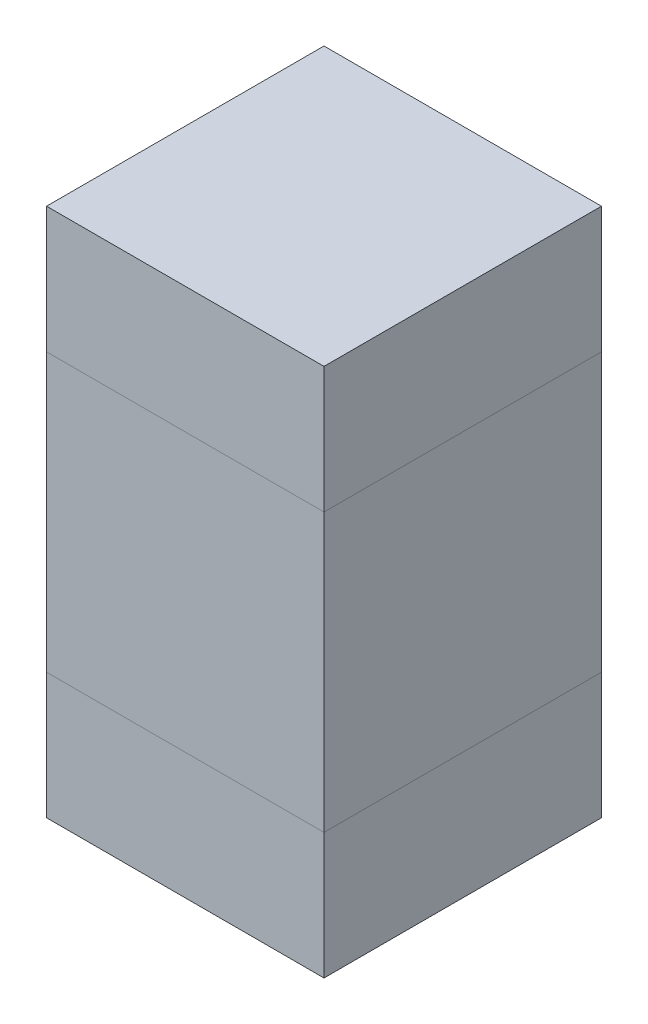
ISO-10303-21;
HEADER;
FILE_DESCRIPTION(('STEP AP214'),'2;1');
FILE_NAME('part.step','',(''),(''),'','','');
FILE_SCHEMA(('AUTOMOTIVE_DESIGN { 1 0 10303 214 1 1 1 1 }'));
ENDSEC;
DATA;
#1=APPLICATION_CONTEXT('core data for automotive mechanical design processes');
#2=APPLICATION_PROTOCOL_DEFINITION('international standard','automotive_design',2000,#1);
#3=PRODUCT_CONTEXT('',#1,'mechanical');
#4=PRODUCT('Part','Part','',(#3));
#5=PRODUCT_RELATED_PRODUCT_CATEGORY('part','',(#4));
#6=PRODUCT_DEFINITION_FORMATION('','',#4);
#7=PRODUCT_DEFINITION_CONTEXT('part definition',#1,'design');
#8=PRODUCT_DEFINITION('design','',#6,#7);
#9=PRODUCT_DEFINITION_SHAPE('','',#8);
#10=(LENGTH_UNIT() NAMED_UNIT(*) SI_UNIT(.MILLI.,.METRE.));
#11=(NAMED_UNIT(*) PLANE_ANGLE_UNIT() SI_UNIT($,.RADIAN.));
#12=(NAMED_UNIT(*) SI_UNIT($,.STERADIAN.) SOLID_ANGLE_UNIT());
#13=UNCERTAINTY_MEASURE_WITH_UNIT(LENGTH_MEASURE(1.E-05),#10,'distance_accuracy_value','');
#14=(GEOMETRIC_REPRESENTATION_CONTEXT(3) GLOBAL_UNCERTAINTY_ASSIGNED_CONTEXT((#13)) GLOBAL_UNIT_ASSIGNED_CONTEXT((#10,
#11,#12)) REPRESENTATION_CONTEXT('',''));
#15=CARTESIAN_POINT('',(0.,0.,0.));
#16=DIRECTION('',(0.,0.,1.));
#17=DIRECTION('',(1.,0.,0.));
#18=AXIS2_PLACEMENT_3D('',#15,#16,#17);
#19=CARTESIAN_POINT('',(9.704995246641,7.339999169844,0.32999934));
#20=DIRECTION('',(0.,0.,-1.));
#21=DIRECTION('',(0.,-1.,0.));
#22=AXIS2_PLACEMENT_3D('',#19,#20,#21);
#23=PLANE('',#22);
#24=DIRECTION('',(1.,0.,0.));
#25=VECTOR('',#24,1.);
#26=CARTESIAN_POINT('',(9.704995246641,7.339999169844,0.32999934));
#27=LINE('',#26,#25);
#28=CARTESIAN_POINT('',(9.704995246641,7.339999169844,0.32999934));
#29=VERTEX_POINT('',#28);
#30=CARTESIAN_POINT('',(10.034997126641,7.339999169844,0.32999934));
#31=VERTEX_POINT('',#30);
#32=EDGE_CURVE('P0_E96',#29,#31,#27,.T.);
#33=ORIENTED_EDGE('',*,*,#32,.T.);
#34=DIRECTION('',(0.,1.,0.));
#35=VECTOR('',#34,1.);
#36=CARTESIAN_POINT('',(10.034997126641,7.339999169844,0.32999934));
#37=LINE('',#36,#35);
#38=CARTESIAN_POINT('',(10.034997126641,7.489998869844,0.32999934));
#39=VERTEX_POINT('',#38);
#40=EDGE_CURVE('P0_E77',#31,#39,#37,.T.);
#41=ORIENTED_EDGE('',*,*,#40,.T.);
#42=DIRECTION('',(-1.,0.,0.));
#43=VECTOR('',#42,1.);
#44=CARTESIAN_POINT('',(10.034997126641,7.489998869844,0.32999934));
#45=LINE('',#44,#43);
#46=CARTESIAN_POINT('',(9.704995246641,7.489998869844,0.32999934));
#47=VERTEX_POINT('',#46);
#48=EDGE_CURVE('P0_E81',#39,#47,#45,.T.);
#49=ORIENTED_EDGE('',*,*,#48,.T.);
#50=DIRECTION('',(0.,-1.,0.));
#51=VECTOR('',#50,1.);
#52=CARTESIAN_POINT('',(9.704995246641,7.489998869844,0.32999934));
#53=LINE('',#52,#51);
#54=EDGE_CURVE('P0_E11',#47,#29,#53,.T.);
#55=ORIENTED_EDGE('',*,*,#54,.T.);
#56=EDGE_LOOP('',(#33,#41,#49,#55));
#57=FACE_BOUND('',#56,.T.);
#58=ADVANCED_FACE('P0_F17',(#57),#23,.F.);
#59=CARTESIAN_POINT('',(9.704995246641,7.339999169844,0.));
#60=DIRECTION('',(0.,0.,-1.));
#61=DIRECTION('',(0.,-1.,0.));
#62=AXIS2_PLACEMENT_3D('',#59,#60,#61);
#63=PLANE('',#62);
#64=DIRECTION('',(0.,-1.,0.));
#65=VECTOR('',#64,1.);
#66=CARTESIAN_POINT('',(9.704995246641,7.489998869844,0.));
#67=LINE('',#66,#65);
#68=CARTESIAN_POINT('',(9.704995246641,7.489998869844,0.));
#69=VERTEX_POINT('',#68);
#70=CARTESIAN_POINT('',(9.704995246641,7.339999169844,0.));
#71=VERTEX_POINT('',#70);
#72=EDGE_CURVE('P0_E25',#69,#71,#67,.T.);
#73=ORIENTED_EDGE('',*,*,#72,.F.);
#74=DIRECTION('',(-1.,0.,0.));
#75=VECTOR('',#74,1.);
#76=CARTESIAN_POINT('',(10.034997126641,7.489998869844,0.));
#77=LINE('',#76,#75);
#78=CARTESIAN_POINT('',(10.034997126641,7.489998869844,0.));
#79=VERTEX_POINT('',#78);
#80=EDGE_CURVE('P0_E67',#79,#69,#77,.T.);
#81=ORIENTED_EDGE('',*,*,#80,.F.);
#82=DIRECTION('',(0.,1.,0.));
#83=VECTOR('',#82,1.);
#84=CARTESIAN_POINT('',(10.034997126641,7.339999169844,0.));
#85=LINE('',#84,#83);
#86=CARTESIAN_POINT('',(10.034997126641,7.339999169844,0.));
#87=VERTEX_POINT('',#86);
#88=EDGE_CURVE('P0_E71',#87,#79,#85,.T.);
#89=ORIENTED_EDGE('',*,*,#88,.F.);
#90=DIRECTION('',(1.,0.,0.));
#91=VECTOR('',#90,1.);
#92=CARTESIAN_POINT('',(9.704995246641,7.339999169844,0.));
#93=LINE('',#92,#91);
#94=EDGE_CURVE('P0_E99',#71,#87,#93,.T.);
#95=ORIENTED_EDGE('',*,*,#94,.F.);
#96=EDGE_LOOP('',(#73,#81,#89,#95));
#97=FACE_BOUND('',#96,.T.);
#98=ADVANCED_FACE('P0_F69',(#97),#63,.T.);
#99=CARTESIAN_POINT('',(9.704995246641,7.489998869844,0.));
#100=DIRECTION('',(1.,0.,0.));
#101=DIRECTION('',(0.,1.,0.));
#102=AXIS2_PLACEMENT_3D('',#99,#100,#101);
#103=PLANE('',#102);
#104=ORIENTED_EDGE('',*,*,#72,.T.);
#105=DIRECTION('',(0.,0.,1.));
#106=VECTOR('',#105,1.);
#107=CARTESIAN_POINT('',(9.704995246641,7.339999169844,0.));
#108=LINE('',#107,#106);
#109=EDGE_CURVE('P0_E91',#71,#29,#108,.T.);
#110=ORIENTED_EDGE('',*,*,#109,.T.);
#111=ORIENTED_EDGE('',*,*,#54,.F.);
#112=DIRECTION('',(0.,0.,1.));
#113=VECTOR('',#112,1.);
#114=CARTESIAN_POINT('',(9.704995246641,7.489998869844,0.));
#115=LINE('',#114,#113);
#116=EDGE_CURVE('P0_E76',#69,#47,#115,.T.);
#117=ORIENTED_EDGE('',*,*,#116,.F.);
#118=EDGE_LOOP('',(#104,#110,#111,#117));
#119=FACE_BOUND('',#118,.T.);
#120=ADVANCED_FACE('P0_F119',(#119),#103,.F.);
#121=CARTESIAN_POINT('',(10.034997126641,7.489998869844,0.));
#122=DIRECTION('',(0.,-1.,0.));
#123=DIRECTION('',(0.,0.,-1.));
#124=AXIS2_PLACEMENT_3D('',#121,#122,#123);
#125=PLANE('',#124);
#126=ORIENTED_EDGE('',*,*,#80,.T.);
#127=ORIENTED_EDGE('',*,*,#116,.T.);
#128=ORIENTED_EDGE('',*,*,#48,.F.);
#129=DIRECTION('',(0.,0.,1.));
#130=VECTOR('',#129,1.);
#131=CARTESIAN_POINT('',(10.034997126641,7.489998869844,0.));
#132=LINE('',#131,#130);
#133=EDGE_CURVE('P0_E79',#79,#39,#132,.T.);
#134=ORIENTED_EDGE('',*,*,#133,.F.);
#135=EDGE_LOOP('',(#126,#127,#128,#134));
#136=FACE_BOUND('',#135,.T.);
#137=ADVANCED_FACE('P0_F80',(#136),#125,.F.);
#138=CARTESIAN_POINT('',(10.034997126641,7.339999169844,0.));
#139=DIRECTION('',(-1.,0.,0.));
#140=DIRECTION('',(0.,0.,1.));
#141=AXIS2_PLACEMENT_3D('',#138,#139,#140);
#142=PLANE('',#141);
#143=ORIENTED_EDGE('',*,*,#88,.T.);
#144=ORIENTED_EDGE('',*,*,#133,.T.);
#145=ORIENTED_EDGE('',*,*,#40,.F.);
#146=DIRECTION('',(0.,0.,1.));
#147=VECTOR('',#146,1.);
#148=CARTESIAN_POINT('',(10.034997126641,7.339999169844,0.));
#149=LINE('',#148,#147);
#150=EDGE_CURVE('P0_E88',#87,#31,#149,.T.);
#151=ORIENTED_EDGE('',*,*,#150,.F.);
#152=EDGE_LOOP('',(#143,#144,#145,#151));
#153=FACE_BOUND('',#152,.T.);
#154=ADVANCED_FACE('P0_F86',(#153),#142,.F.);
#155=CARTESIAN_POINT('',(9.704995246641,7.339999169844,0.));
#156=DIRECTION('',(0.,1.,0.));
#157=DIRECTION('',(1.,0.,0.));
#158=AXIS2_PLACEMENT_3D('',#155,#156,#157);
#159=PLANE('',#158);
#160=ORIENTED_EDGE('',*,*,#94,.T.);
#161=ORIENTED_EDGE('',*,*,#150,.T.);
#162=ORIENTED_EDGE('',*,*,#32,.F.);
#163=ORIENTED_EDGE('',*,*,#109,.F.);
#164=EDGE_LOOP('',(#160,#161,#162,#163));
#165=FACE_BOUND('',#164,.T.);
#166=ADVANCED_FACE('P0_F118',(#165),#159,.F.);
#167=CLOSED_SHELL('',(#58,#98,#120,#137,#154,#166));
#168=MANIFOLD_SOLID_BREP('P0_B1',#167);
#169=CARTESIAN_POINT('',(9.704995246641,6.860003442305,0.32999934));
#170=DIRECTION('',(0.,0.,-1.));
#171=DIRECTION('',(0.,-1.,0.));
#172=AXIS2_PLACEMENT_3D('',#169,#170,#171);
#173=PLANE('',#172);
#174=DIRECTION('',(1.,0.,0.));
#175=VECTOR('',#174,1.);
#176=CARTESIAN_POINT('',(9.704995246641,6.860003442305,0.32999934));
#177=LINE('',#176,#175);
#178=CARTESIAN_POINT('',(9.704995246641,6.860003442305,0.32999934));
#179=VERTEX_POINT('',#178);
#180=CARTESIAN_POINT('',(10.034997126641,6.860003442305,0.32999934));
#181=VERTEX_POINT('',#180);
#182=EDGE_CURVE('P1_E83',#179,#181,#177,.T.);
#183=ORIENTED_EDGE('',*,*,#182,.T.);
#184=DIRECTION('',(0.,1.,0.));
#185=VECTOR('',#184,1.);
#186=CARTESIAN_POINT('',(10.034997126641,6.860003442305,0.32999934));
#187=LINE('',#186,#185);
#188=CARTESIAN_POINT('',(10.034997126641,7.010003142305,0.32999934));
#189=VERTEX_POINT('',#188);
#190=EDGE_CURVE('P1_E105',#181,#189,#187,.T.);
#191=ORIENTED_EDGE('',*,*,#190,.T.);
#192=DIRECTION('',(-1.,0.,0.));
#193=VECTOR('',#192,1.);
#194=CARTESIAN_POINT('',(10.034997126641,7.010003142305,0.32999934));
#195=LINE('',#194,#193);
#196=CARTESIAN_POINT('',(9.704995246641,7.010003142305,0.32999934));
#197=VERTEX_POINT('',#196);
#198=EDGE_CURVE('P1_E20',#189,#197,#195,.T.);
#199=ORIENTED_EDGE('',*,*,#198,.T.);
#200=DIRECTION('',(0.,-1.,0.));
#201=VECTOR('',#200,1.);
#202=CARTESIAN_POINT('',(9.704995246641,7.010003142305,0.32999934));
#203=LINE('',#202,#201);
#204=EDGE_CURVE('P1_E11',#197,#179,#203,.T.);
#205=ORIENTED_EDGE('',*,*,#204,.T.);
#206=EDGE_LOOP('',(#183,#191,#199,#205));
#207=FACE_BOUND('',#206,.T.);
#208=ADVANCED_FACE('P1_F17',(#207),#173,.F.);
#209=CARTESIAN_POINT('',(9.704995246641,6.860003442305,0.));
#210=DIRECTION('',(0.,0.,-1.));
#211=DIRECTION('',(0.,-1.,0.));
#212=AXIS2_PLACEMENT_3D('',#209,#210,#211);
#213=PLANE('',#212);
#214=DIRECTION('',(0.,-1.,0.));
#215=VECTOR('',#214,1.);
#216=CARTESIAN_POINT('',(9.704995246641,7.010003142305,0.));
#217=LINE('',#216,#215);
#218=CARTESIAN_POINT('',(9.704995246641,7.010003142305,0.));
#219=VERTEX_POINT('',#218);
#220=CARTESIAN_POINT('',(9.704995246641,6.860003442305,0.));
#221=VERTEX_POINT('',#220);
#222=EDGE_CURVE('P1_E26',#219,#221,#217,.T.);
#223=ORIENTED_EDGE('',*,*,#222,.F.);
#224=DIRECTION('',(-1.,0.,0.));
#225=VECTOR('',#224,1.);
#226=CARTESIAN_POINT('',(10.034997126641,7.010003142305,0.));
#227=LINE('',#226,#225);
#228=CARTESIAN_POINT('',(10.034997126641,7.010003142305,0.));
#229=VERTEX_POINT('',#228);
#230=EDGE_CURVE('P1_E109',#229,#219,#227,.T.);
#231=ORIENTED_EDGE('',*,*,#230,.F.);
#232=DIRECTION('',(0.,1.,0.));
#233=VECTOR('',#232,1.);
#234=CARTESIAN_POINT('',(10.034997126641,6.860003442305,0.));
#235=LINE('',#234,#233);
#236=CARTESIAN_POINT('',(10.034997126641,6.860003442305,0.));
#237=VERTEX_POINT('',#236);
#238=EDGE_CURVE('P1_E85',#237,#229,#235,.T.);
#239=ORIENTED_EDGE('',*,*,#238,.F.);
#240=DIRECTION('',(1.,0.,0.));
#241=VECTOR('',#240,1.);
#242=CARTESIAN_POINT('',(9.704995246641,6.860003442305,0.));
#243=LINE('',#242,#241);
#244=EDGE_CURVE('P1_E81',#221,#237,#243,.T.);
#245=ORIENTED_EDGE('',*,*,#244,.F.);
#246=EDGE_LOOP('',(#223,#231,#239,#245));
#247=FACE_BOUND('',#246,.T.);
#248=ADVANCED_FACE('P1_F87',(#247),#213,.T.);
#249=CARTESIAN_POINT('',(9.704995246641,7.010003142305,0.));
#250=DIRECTION('',(1.,0.,0.));
#251=DIRECTION('',(0.,1.,0.));
#252=AXIS2_PLACEMENT_3D('',#249,#250,#251);
#253=PLANE('',#252);
#254=ORIENTED_EDGE('',*,*,#222,.T.);
#255=DIRECTION('',(0.,0.,1.));
#256=VECTOR('',#255,1.);
#257=CARTESIAN_POINT('',(9.704995246641,6.860003442305,0.));
#258=LINE('',#257,#256);
#259=EDGE_CURVE('P1_E70',#221,#179,#258,.T.);
#260=ORIENTED_EDGE('',*,*,#259,.T.);
#261=ORIENTED_EDGE('',*,*,#204,.F.);
#262=DIRECTION('',(0.,0.,1.));
#263=VECTOR('',#262,1.);
#264=CARTESIAN_POINT('',(9.704995246641,7.010003142305,0.));
#265=LINE('',#264,#263);
#266=EDGE_CURVE('P1_E73',#219,#197,#265,.T.);
#267=ORIENTED_EDGE('',*,*,#266,.F.);
#268=EDGE_LOOP('',(#254,#260,#261,#267));
#269=FACE_BOUND('',#268,.T.);
#270=ADVANCED_FACE('P1_F69',(#269),#253,.F.);
#271=CARTESIAN_POINT('',(10.034997126641,7.010003142305,0.));
#272=DIRECTION('',(0.,-1.,0.));
#273=DIRECTION('',(0.,0.,-1.));
#274=AXIS2_PLACEMENT_3D('',#271,#272,#273);
#275=PLANE('',#274);
#276=ORIENTED_EDGE('',*,*,#230,.T.);
#277=ORIENTED_EDGE('',*,*,#266,.T.);
#278=ORIENTED_EDGE('',*,*,#198,.F.);
#279=DIRECTION('',(0.,0.,1.));
#280=VECTOR('',#279,1.);
#281=CARTESIAN_POINT('',(10.034997126641,7.010003142305,0.));
#282=LINE('',#281,#280);
#283=EDGE_CURVE('P1_E101',#229,#189,#282,.T.);
#284=ORIENTED_EDGE('',*,*,#283,.F.);
#285=EDGE_LOOP('',(#276,#277,#278,#284));
#286=FACE_BOUND('',#285,.T.);
#287=ADVANCED_FACE('P1_F119',(#286),#275,.F.);
#288=CARTESIAN_POINT('',(10.034997126641,6.860003442305,0.));
#289=DIRECTION('',(-1.,0.,0.));
#290=DIRECTION('',(0.,0.,1.));
#291=AXIS2_PLACEMENT_3D('',#288,#289,#290);
#292=PLANE('',#291);
#293=ORIENTED_EDGE('',*,*,#238,.T.);
#294=ORIENTED_EDGE('',*,*,#283,.T.);
#295=ORIENTED_EDGE('',*,*,#190,.F.);
#296=DIRECTION('',(0.,0.,1.));
#297=VECTOR('',#296,1.);
#298=CARTESIAN_POINT('',(10.034997126641,6.860003442305,0.));
#299=LINE('',#298,#297);
#300=EDGE_CURVE('P1_E91',#237,#181,#299,.T.);
#301=ORIENTED_EDGE('',*,*,#300,.F.);
#302=EDGE_LOOP('',(#293,#294,#295,#301));
#303=FACE_BOUND('',#302,.T.);
#304=ADVANCED_FACE('P1_F121',(#303),#292,.F.);
#305=CARTESIAN_POINT('',(9.704995246641,6.860003442305,0.));
#306=DIRECTION('',(0.,1.,0.));
#307=DIRECTION('',(1.,0.,0.));
#308=AXIS2_PLACEMENT_3D('',#305,#306,#307);
#309=PLANE('',#308);
#310=ORIENTED_EDGE('',*,*,#244,.T.);
#311=ORIENTED_EDGE('',*,*,#300,.T.);
#312=ORIENTED_EDGE('',*,*,#182,.F.);
#313=ORIENTED_EDGE('',*,*,#259,.F.);
#314=EDGE_LOOP('',(#310,#311,#312,#313));
#315=FACE_BOUND('',#314,.T.);
#316=ADVANCED_FACE('P1_F79',(#315),#309,.F.);
#317=CLOSED_SHELL('',(#208,#248,#270,#287,#304,#316));
#318=MANIFOLD_SOLID_BREP('P1_B1',#317);
#319=CARTESIAN_POINT('',(9.704995246641,7.010001486074,0.32999934));
#320=DIRECTION('',(0.,0.,-1.));
#321=DIRECTION('',(0.,-1.,0.));
#322=AXIS2_PLACEMENT_3D('',#319,#320,#321);
#323=PLANE('',#322);
#324=DIRECTION('',(1.,0.,0.));
#325=VECTOR('',#324,1.);
#326=CARTESIAN_POINT('',(9.704995246641,7.010001486074,0.32999934));
#327=LINE('',#326,#325);
#328=CARTESIAN_POINT('',(9.704995246641,7.010001486074,0.32999934));
#329=VERTEX_POINT('',#328);
#330=CARTESIAN_POINT('',(10.034997126641,7.010001486074,0.32999934));
#331=VERTEX_POINT('',#330);
#332=EDGE_CURVE('P2_E81',#329,#331,#327,.T.);
#333=ORIENTED_EDGE('',*,*,#332,.T.);
#334=DIRECTION('',(0.,1.,0.));
#335=VECTOR('',#334,1.);
#336=CARTESIAN_POINT('',(10.034997126641,7.010001486074,0.32999934));
#337=LINE('',#336,#335);
#338=CARTESIAN_POINT('',(10.034997126641,7.340000826074,0.32999934));
#339=VERTEX_POINT('',#338);
#340=EDGE_CURVE('P2_E102',#331,#339,#337,.T.);
#341=ORIENTED_EDGE('',*,*,#340,.T.);
#342=DIRECTION('',(-1.,0.,0.));
#343=VECTOR('',#342,1.);
#344=CARTESIAN_POINT('',(10.034997126641,7.340000826074,0.32999934));
#345=LINE('',#344,#343);
#346=CARTESIAN_POINT('',(9.704995246641,7.340000826074,0.32999934));
#347=VERTEX_POINT('',#346);
#348=EDGE_CURVE('P2_E74',#339,#347,#345,.T.);
#349=ORIENTED_EDGE('',*,*,#348,.T.);
#350=DIRECTION('',(0.,-1.,0.));
#351=VECTOR('',#350,1.);
#352=CARTESIAN_POINT('',(9.704995246641,7.340000826074,0.32999934));
#353=LINE('',#352,#351);
#354=EDGE_CURVE('P2_E11',#347,#329,#353,.T.);
#355=ORIENTED_EDGE('',*,*,#354,.T.);
#356=EDGE_LOOP('',(#333,#341,#349,#355));
#357=FACE_BOUND('',#356,.T.);
#358=ADVANCED_FACE('P2_F17',(#357),#323,.F.);
#359=CARTESIAN_POINT('',(9.704995246641,7.010001486074,0.));
#360=DIRECTION('',(0.,0.,-1.));
#361=DIRECTION('',(0.,-1.,0.));
#362=AXIS2_PLACEMENT_3D('',#359,#360,#361);
#363=PLANE('',#362);
#364=DIRECTION('',(0.,-1.,0.));
#365=VECTOR('',#364,1.);
#366=CARTESIAN_POINT('',(9.704995246641,7.340000826074,0.));
#367=LINE('',#366,#365);
#368=CARTESIAN_POINT('',(9.704995246641,7.340000826074,0.));
#369=VERTEX_POINT('',#368);
#370=CARTESIAN_POINT('',(9.704995246641,7.010001486074,0.));
#371=VERTEX_POINT('',#370);
#372=EDGE_CURVE('P2_E25',#369,#371,#367,.T.);
#373=ORIENTED_EDGE('',*,*,#372,.F.);
#374=DIRECTION('',(-1.,0.,0.));
#375=VECTOR('',#374,1.);
#376=CARTESIAN_POINT('',(10.034997126641,7.340000826074,0.));
#377=LINE('',#376,#375);
#378=CARTESIAN_POINT('',(10.034997126641,7.340000826074,0.));
#379=VERTEX_POINT('',#378);
#380=EDGE_CURVE('P2_E99',#379,#369,#377,.T.);
#381=ORIENTED_EDGE('',*,*,#380,.F.);
#382=DIRECTION('',(0.,1.,0.));
#383=VECTOR('',#382,1.);
#384=CARTESIAN_POINT('',(10.034997126641,7.010001486074,0.));
#385=LINE('',#384,#383);
#386=CARTESIAN_POINT('',(10.034997126641,7.010001486074,0.));
#387=VERTEX_POINT('',#386);
#388=EDGE_CURVE('P2_E83',#387,#379,#385,.T.);
#389=ORIENTED_EDGE('',*,*,#388,.F.);
#390=DIRECTION('',(1.,0.,0.));
#391=VECTOR('',#390,1.);
#392=CARTESIAN_POINT('',(9.704995246641,7.010001486074,0.));
#393=LINE('',#392,#391);
#394=EDGE_CURVE('P2_E79',#371,#387,#393,.T.);
#395=ORIENTED_EDGE('',*,*,#394,.F.);
#396=EDGE_LOOP('',(#373,#381,#389,#395));
#397=FACE_BOUND('',#396,.T.);
#398=ADVANCED_FACE('P2_F85',(#397),#363,.T.);
#399=CARTESIAN_POINT('',(9.704995246641,7.340000826074,0.));
#400=DIRECTION('',(1.,0.,0.));
#401=DIRECTION('',(0.,1.,0.));
#402=AXIS2_PLACEMENT_3D('',#399,#400,#401);
#403=PLANE('',#402);
#404=ORIENTED_EDGE('',*,*,#372,.T.);
#405=DIRECTION('',(0.,0.,1.));
#406=VECTOR('',#405,1.);
#407=CARTESIAN_POINT('',(9.704995246641,7.010001486074,0.));
#408=LINE('',#407,#406);
#409=EDGE_CURVE('P2_E68',#371,#329,#408,.T.);
#410=ORIENTED_EDGE('',*,*,#409,.T.);
#411=ORIENTED_EDGE('',*,*,#354,.F.);
#412=DIRECTION('',(0.,0.,1.));
#413=VECTOR('',#412,1.);
#414=CARTESIAN_POINT('',(9.704995246641,7.340000826074,0.));
#415=LINE('',#414,#413);
#416=EDGE_CURVE('P2_E71',#369,#347,#415,.T.);
#417=ORIENTED_EDGE('',*,*,#416,.F.);
#418=EDGE_LOOP('',(#404,#410,#411,#417));
#419=FACE_BOUND('',#418,.T.);
#420=ADVANCED_FACE('P2_F67',(#419),#403,.F.);
#421=CARTESIAN_POINT('',(10.034997126641,7.340000826074,0.));
#422=DIRECTION('',(0.,-1.,0.));
#423=DIRECTION('',(0.,0.,-1.));
#424=AXIS2_PLACEMENT_3D('',#421,#422,#423);
#425=PLANE('',#424);
#426=ORIENTED_EDGE('',*,*,#380,.T.);
#427=ORIENTED_EDGE('',*,*,#416,.T.);
#428=ORIENTED_EDGE('',*,*,#348,.F.);
#429=DIRECTION('',(0.,0.,1.));
#430=VECTOR('',#429,1.);
#431=CARTESIAN_POINT('',(10.034997126641,7.340000826074,0.));
#432=LINE('',#431,#430);
#433=EDGE_CURVE('P2_E106',#379,#339,#432,.T.);
#434=ORIENTED_EDGE('',*,*,#433,.F.);
#435=EDGE_LOOP('',(#426,#427,#428,#434));
#436=FACE_BOUND('',#435,.T.);
#437=ADVANCED_FACE('P2_F116',(#436),#425,.F.);
#438=CARTESIAN_POINT('',(10.034997126641,7.010001486074,0.));
#439=DIRECTION('',(-1.,0.,0.));
#440=DIRECTION('',(0.,0.,1.));
#441=AXIS2_PLACEMENT_3D('',#438,#439,#440);
#442=PLANE('',#441);
#443=ORIENTED_EDGE('',*,*,#388,.T.);
#444=ORIENTED_EDGE('',*,*,#433,.T.);
#445=ORIENTED_EDGE('',*,*,#340,.F.);
#446=DIRECTION('',(0.,0.,1.));
#447=VECTOR('',#446,1.);
#448=CARTESIAN_POINT('',(10.034997126641,7.010001486074,0.));
#449=LINE('',#448,#447);
#450=EDGE_CURVE('P2_E89',#387,#331,#449,.T.);
#451=ORIENTED_EDGE('',*,*,#450,.F.);
#452=EDGE_LOOP('',(#443,#444,#445,#451));
#453=FACE_BOUND('',#452,.T.);
#454=ADVANCED_FACE('P2_F118',(#453),#442,.F.);
#455=CARTESIAN_POINT('',(9.704995246641,7.010001486074,0.));
#456=DIRECTION('',(0.,1.,0.));
#457=DIRECTION('',(1.,0.,0.));
#458=AXIS2_PLACEMENT_3D('',#455,#456,#457);
#459=PLANE('',#458);
#460=ORIENTED_EDGE('',*,*,#394,.T.);
#461=ORIENTED_EDGE('',*,*,#450,.T.);
#462=ORIENTED_EDGE('',*,*,#332,.F.);
#463=ORIENTED_EDGE('',*,*,#409,.F.);
#464=EDGE_LOOP('',(#460,#461,#462,#463));
#465=FACE_BOUND('',#464,.T.);
#466=ADVANCED_FACE('P2_F77',(#465),#459,.F.);
#467=CLOSED_SHELL('',(#358,#398,#420,#437,#454,#466));
#468=MANIFOLD_SOLID_BREP('P2_B1',#467);
#469=ADVANCED_BREP_SHAPE_REPRESENTATION('',(#18,#168,#318,#468),#14);
#470=SHAPE_DEFINITION_REPRESENTATION(#9,#469);
ENDSEC;
END-ISO-10303-21;
